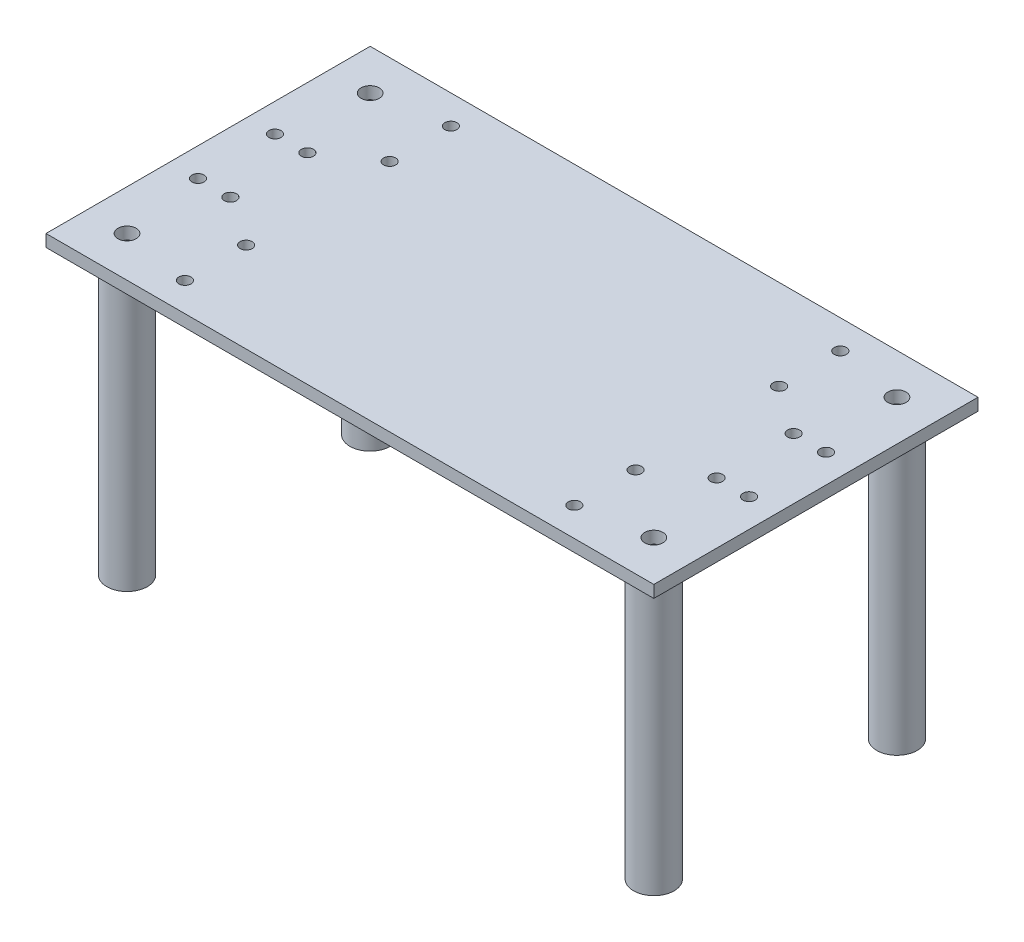
ISO-10303-21;
HEADER;
FILE_DESCRIPTION(('STEP AP214'),'2;1');
FILE_NAME('part.step','',(''),(''),'','','');
FILE_SCHEMA(('AUTOMOTIVE_DESIGN { 1 0 10303 214 1 1 1 1 }'));
ENDSEC;
DATA;
#1=APPLICATION_CONTEXT('core data for automotive mechanical design processes');
#2=APPLICATION_PROTOCOL_DEFINITION('international standard','automotive_design',2000,#1);
#3=PRODUCT_CONTEXT('',#1,'mechanical');
#4=PRODUCT('Part','Part','',(#3));
#5=PRODUCT_RELATED_PRODUCT_CATEGORY('part','',(#4));
#6=PRODUCT_DEFINITION_FORMATION('','',#4);
#7=PRODUCT_DEFINITION_CONTEXT('part definition',#1,'design');
#8=PRODUCT_DEFINITION('design','',#6,#7);
#9=PRODUCT_DEFINITION_SHAPE('','',#8);
#10=(LENGTH_UNIT() NAMED_UNIT(*) SI_UNIT(.MILLI.,.METRE.));
#11=(NAMED_UNIT(*) PLANE_ANGLE_UNIT() SI_UNIT($,.RADIAN.));
#12=(NAMED_UNIT(*) SI_UNIT($,.STERADIAN.) SOLID_ANGLE_UNIT());
#13=UNCERTAINTY_MEASURE_WITH_UNIT(LENGTH_MEASURE(1.E-05),#10,'distance_accuracy_value','');
#14=(GEOMETRIC_REPRESENTATION_CONTEXT(3) GLOBAL_UNCERTAINTY_ASSIGNED_CONTEXT((#13)) GLOBAL_UNIT_ASSIGNED_CONTEXT((#10,
#11,#12)) REPRESENTATION_CONTEXT('',''));
#15=CARTESIAN_POINT('',(0.,0.,0.));
#16=DIRECTION('',(0.,0.,1.));
#17=DIRECTION('',(1.,0.,0.));
#18=AXIS2_PLACEMENT_3D('',#15,#16,#17);
#19=CARTESIAN_POINT('',(66.5352697095436,-3.,0.));
#20=DIRECTION('',(-1.,0.,0.));
#21=DIRECTION('',(0.,0.,1.));
#22=AXIS2_PLACEMENT_3D('',#19,#20,#21);
#23=PLANE('',#22);
#24=DIRECTION('',(0.,0.,1.));
#25=VECTOR('',#24,1.);
#26=CARTESIAN_POINT('',(66.5352697095436,0.,0.));
#27=LINE('',#26,#25);
#28=CARTESIAN_POINT('',(66.5352697095435,0.,-41.8257261410789));
#29=VERTEX_POINT('',#28);
#30=CARTESIAN_POINT('',(66.5352697095436,0.,38.1742738589212));
#31=VERTEX_POINT('',#30);
#32=EDGE_CURVE('E129',#29,#31,#27,.T.);
#33=ORIENTED_EDGE('',*,*,#32,.T.);
#34=DIRECTION('',(0.,1.,0.));
#35=VECTOR('',#34,1.);
#36=CARTESIAN_POINT('',(66.5352697095436,-3.,38.1742738589212));
#37=LINE('',#36,#35);
#38=CARTESIAN_POINT('',(66.5352697095436,-3.,38.1742738589212));
#39=VERTEX_POINT('',#38);
#40=EDGE_CURVE('E78',#39,#31,#37,.T.);
#41=ORIENTED_EDGE('',*,*,#40,.F.);
#42=DIRECTION('',(0.,0.,1.));
#43=VECTOR('',#42,1.);
#44=CARTESIAN_POINT('',(66.5352697095436,-3.,0.));
#45=LINE('',#44,#43);
#46=CARTESIAN_POINT('',(66.5352697095435,-3.,-41.8257261410789));
#47=VERTEX_POINT('',#46);
#48=EDGE_CURVE('E54',#47,#39,#45,.T.);
#49=ORIENTED_EDGE('',*,*,#48,.F.);
#50=DIRECTION('',(0.,1.,0.));
#51=VECTOR('',#50,1.);
#52=CARTESIAN_POINT('',(66.5352697095435,-3.,-41.8257261410789));
#53=LINE('',#52,#51);
#54=EDGE_CURVE('E92',#47,#29,#53,.T.);
#55=ORIENTED_EDGE('',*,*,#54,.T.);
#56=EDGE_LOOP('',(#33,#41,#49,#55));
#57=FACE_BOUND('',#56,.T.);
#58=ADVANCED_FACE('F35',(#57),#23,.F.);
#59=CARTESIAN_POINT('',(0.,-3.,38.1742738589212));
#60=DIRECTION('',(0.,0.,1.));
#61=DIRECTION('',(1.,0.,0.));
#62=AXIS2_PLACEMENT_3D('',#59,#60,#61);
#63=PLANE('',#62);
#64=DIRECTION('',(1.,0.,0.));
#65=VECTOR('',#64,1.);
#66=CARTESIAN_POINT('',(0.,0.,38.1742738589212));
#67=LINE('',#66,#65);
#68=CARTESIAN_POINT('',(-83.4647302904564,0.,38.1742738589212));
#69=VERTEX_POINT('',#68);
#70=EDGE_CURVE('E134',#69,#31,#67,.T.);
#71=ORIENTED_EDGE('',*,*,#70,.F.);
#72=DIRECTION('',(0.,1.,0.));
#73=VECTOR('',#72,1.);
#74=CARTESIAN_POINT('',(-83.4647302904564,-3.,38.1742738589212));
#75=LINE('',#74,#73);
#76=CARTESIAN_POINT('',(-83.4647302904564,-3.,38.1742738589212));
#77=VERTEX_POINT('',#76);
#78=EDGE_CURVE('E71',#77,#69,#75,.T.);
#79=ORIENTED_EDGE('',*,*,#78,.F.);
#80=DIRECTION('',(1.,0.,0.));
#81=VECTOR('',#80,1.);
#82=CARTESIAN_POINT('',(0.,-3.,38.1742738589212));
#83=LINE('',#82,#81);
#84=EDGE_CURVE('E99',#77,#39,#83,.T.);
#85=ORIENTED_EDGE('',*,*,#84,.T.);
#86=ORIENTED_EDGE('',*,*,#40,.T.);
#87=EDGE_LOOP('',(#71,#79,#85,#86));
#88=FACE_BOUND('',#87,.T.);
#89=ADVANCED_FACE('F315',(#88),#63,.T.);
#90=CARTESIAN_POINT('',(-83.4647302904564,-3.,0.));
#91=DIRECTION('',(-1.,0.,0.));
#92=DIRECTION('',(0.,0.,1.));
#93=AXIS2_PLACEMENT_3D('',#90,#91,#92);
#94=PLANE('',#93);
#95=DIRECTION('',(0.,0.,1.));
#96=VECTOR('',#95,1.);
#97=CARTESIAN_POINT('',(-83.4647302904564,0.,0.));
#98=LINE('',#97,#96);
#99=CARTESIAN_POINT('',(-83.4647302904565,0.,-41.8257261410789));
#100=VERTEX_POINT('',#99);
#101=EDGE_CURVE('E89',#100,#69,#98,.T.);
#102=ORIENTED_EDGE('',*,*,#101,.F.);
#103=DIRECTION('',(0.,1.,0.));
#104=VECTOR('',#103,1.);
#105=CARTESIAN_POINT('',(-83.4647302904565,-3.,-41.8257261410789));
#106=LINE('',#105,#104);
#107=CARTESIAN_POINT('',(-83.4647302904565,-3.,-41.8257261410789));
#108=VERTEX_POINT('',#107);
#109=EDGE_CURVE('E86',#108,#100,#106,.T.);
#110=ORIENTED_EDGE('',*,*,#109,.F.);
#111=DIRECTION('',(0.,0.,1.));
#112=VECTOR('',#111,1.);
#113=CARTESIAN_POINT('',(-83.4647302904564,-3.,0.));
#114=LINE('',#113,#112);
#115=EDGE_CURVE('E88',#108,#77,#114,.T.);
#116=ORIENTED_EDGE('',*,*,#115,.T.);
#117=ORIENTED_EDGE('',*,*,#78,.T.);
#118=EDGE_LOOP('',(#102,#110,#116,#117));
#119=FACE_BOUND('',#118,.T.);
#120=ADVANCED_FACE('F87',(#119),#94,.T.);
#121=CARTESIAN_POINT('',(-68.4647302904565,-3.,-11.3257261410788));
#122=DIRECTION('',(0.,1.,0.));
#123=DIRECTION('',(0.,0.,1.));
#124=AXIS2_PLACEMENT_3D('',#121,#122,#123);
#125=CYLINDRICAL_SURFACE('',#124,1.5);
#126=CARTESIAN_POINT('',(-68.4647302904565,-3.,-11.3257261410788));
#127=DIRECTION('',(0.,1.,0.));
#128=DIRECTION('',(0.,0.,1.));
#129=AXIS2_PLACEMENT_3D('',#126,#127,#128);
#130=CIRCLE('',#129,1.5);
#131=CARTESIAN_POINT('',(-68.4647302904565,-3.,-9.82572614107885));
#132=VERTEX_POINT('',#131);
#133=EDGE_CURVE('E113',#132,#132,#130,.T.);
#134=ORIENTED_EDGE('',*,*,#133,.F.);
#135=EDGE_LOOP('',(#134));
#136=FACE_BOUND('',#135,.T.);
#137=CARTESIAN_POINT('',(-68.4647302904565,0.,-11.3257261410788));
#138=DIRECTION('',(0.,1.,0.));
#139=DIRECTION('',(0.,0.,1.));
#140=AXIS2_PLACEMENT_3D('',#137,#138,#139);
#141=CIRCLE('',#140,1.5);
#142=CARTESIAN_POINT('',(-68.4647302904565,0.,-9.82572614107885));
#143=VERTEX_POINT('',#142);
#144=EDGE_CURVE('E146',#143,#143,#141,.T.);
#145=ORIENTED_EDGE('',*,*,#144,.T.);
#146=EDGE_LOOP('',(#145));
#147=FACE_BOUND('',#146,.T.);
#148=ADVANCED_FACE('F785',(#136,#147),#125,.F.);
#149=CARTESIAN_POINT('',(-76.4647302904565,-3.,-11.3257261410788));
#150=DIRECTION('',(0.,1.,0.));
#151=DIRECTION('',(0.,0.,1.));
#152=AXIS2_PLACEMENT_3D('',#149,#150,#151);
#153=CYLINDRICAL_SURFACE('',#152,1.5);
#154=CARTESIAN_POINT('',(-76.4647302904565,-3.,-11.3257261410788));
#155=DIRECTION('',(0.,1.,0.));
#156=DIRECTION('',(0.,0.,1.));
#157=AXIS2_PLACEMENT_3D('',#154,#155,#156);
#158=CIRCLE('',#157,1.5);
#159=CARTESIAN_POINT('',(-76.4647302904565,-3.,-9.82572614107885));
#160=VERTEX_POINT('',#159);
#161=EDGE_CURVE('E110',#160,#160,#158,.T.);
#162=ORIENTED_EDGE('',*,*,#161,.F.);
#163=EDGE_LOOP('',(#162));
#164=FACE_BOUND('',#163,.T.);
#165=CARTESIAN_POINT('',(-76.4647302904565,0.,-11.3257261410788));
#166=DIRECTION('',(0.,1.,0.));
#167=DIRECTION('',(0.,0.,1.));
#168=AXIS2_PLACEMENT_3D('',#165,#166,#167);
#169=CIRCLE('',#168,1.5);
#170=CARTESIAN_POINT('',(-76.4647302904565,0.,-9.82572614107885));
#171=VERTEX_POINT('',#170);
#172=EDGE_CURVE('E143',#171,#171,#169,.T.);
#173=ORIENTED_EDGE('',*,*,#172,.T.);
#174=EDGE_LOOP('',(#173));
#175=FACE_BOUND('',#174,.T.);
#176=ADVANCED_FACE('F776',(#164,#175),#153,.F.);
#177=CARTESIAN_POINT('',(59.5352697095435,-3.,-11.3257261410789));
#178=DIRECTION('',(0.,1.,0.));
#179=DIRECTION('',(0.,0.,1.));
#180=AXIS2_PLACEMENT_3D('',#177,#178,#179);
#181=CYLINDRICAL_SURFACE('',#180,1.5);
#182=CARTESIAN_POINT('',(59.5352697095435,-3.,-11.3257261410789));
#183=DIRECTION('',(0.,1.,0.));
#184=DIRECTION('',(0.,0.,1.));
#185=AXIS2_PLACEMENT_3D('',#182,#183,#184);
#186=CIRCLE('',#185,1.5);
#187=CARTESIAN_POINT('',(59.5352697095435,-3.,-9.82572614107888));
#188=VERTEX_POINT('',#187);
#189=EDGE_CURVE('E107',#188,#188,#186,.F.);
#190=ORIENTED_EDGE('',*,*,#189,.T.);
#191=EDGE_LOOP('',(#190));
#192=FACE_BOUND('',#191,.T.);
#193=CARTESIAN_POINT('',(59.5352697095435,0.,-11.3257261410789));
#194=DIRECTION('',(0.,1.,0.));
#195=DIRECTION('',(0.,0.,1.));
#196=AXIS2_PLACEMENT_3D('',#193,#194,#195);
#197=CIRCLE('',#196,1.5);
#198=CARTESIAN_POINT('',(59.5352697095435,0.,-9.82572614107888));
#199=VERTEX_POINT('',#198);
#200=EDGE_CURVE('E140',#199,#199,#197,.F.);
#201=ORIENTED_EDGE('',*,*,#200,.F.);
#202=EDGE_LOOP('',(#201));
#203=FACE_BOUND('',#202,.T.);
#204=ADVANCED_FACE('F767',(#192,#203),#181,.F.);
#205=CARTESIAN_POINT('',(59.5352697095436,-3.,7.67427385892113));
#206=DIRECTION('',(0.,1.,0.));
#207=DIRECTION('',(0.,0.,1.));
#208=AXIS2_PLACEMENT_3D('',#205,#206,#207);
#209=CYLINDRICAL_SURFACE('',#208,1.5);
#210=CARTESIAN_POINT('',(59.5352697095436,-3.,7.67427385892113));
#211=DIRECTION('',(0.,1.,0.));
#212=DIRECTION('',(0.,0.,1.));
#213=AXIS2_PLACEMENT_3D('',#210,#211,#212);
#214=CIRCLE('',#213,1.5);
#215=CARTESIAN_POINT('',(59.5352697095436,-3.,9.17427385892113));
#216=VERTEX_POINT('',#215);
#217=EDGE_CURVE('E101',#216,#216,#214,.F.);
#218=ORIENTED_EDGE('',*,*,#217,.T.);
#219=EDGE_LOOP('',(#218));
#220=FACE_BOUND('',#219,.T.);
#221=CARTESIAN_POINT('',(59.5352697095436,0.,7.67427385892113));
#222=DIRECTION('',(0.,1.,0.));
#223=DIRECTION('',(0.,0.,1.));
#224=AXIS2_PLACEMENT_3D('',#221,#222,#223);
#225=CIRCLE('',#224,1.5);
#226=CARTESIAN_POINT('',(59.5352697095436,0.,9.17427385892113));
#227=VERTEX_POINT('',#226);
#228=EDGE_CURVE('E137',#227,#227,#225,.F.);
#229=ORIENTED_EDGE('',*,*,#228,.F.);
#230=EDGE_LOOP('',(#229));
#231=FACE_BOUND('',#230,.T.);
#232=ADVANCED_FACE('F760',(#220,#231),#209,.F.);
#233=CARTESIAN_POINT('',(0.,-3.,-41.8257261410789));
#234=DIRECTION('',(0.,0.,1.));
#235=DIRECTION('',(1.,0.,0.));
#236=AXIS2_PLACEMENT_3D('',#233,#234,#235);
#237=PLANE('',#236);
#238=DIRECTION('',(1.,0.,0.));
#239=VECTOR('',#238,1.);
#240=CARTESIAN_POINT('',(0.,0.,-41.8257261410789));
#241=LINE('',#240,#239);
#242=EDGE_CURVE('E131',#100,#29,#241,.T.);
#243=ORIENTED_EDGE('',*,*,#242,.T.);
#244=ORIENTED_EDGE('',*,*,#54,.F.);
#245=DIRECTION('',(1.,0.,0.));
#246=VECTOR('',#245,1.);
#247=CARTESIAN_POINT('',(0.,-3.,-41.8257261410789));
#248=LINE('',#247,#246);
#249=EDGE_CURVE('E83',#108,#47,#248,.T.);
#250=ORIENTED_EDGE('',*,*,#249,.F.);
#251=ORIENTED_EDGE('',*,*,#109,.T.);
#252=EDGE_LOOP('',(#243,#244,#250,#251));
#253=FACE_BOUND('',#252,.T.);
#254=ADVANCED_FACE('F94',(#253),#237,.F.);
#255=CARTESIAN_POINT('',(-68.4647302904565,-3.,7.67427385892115));
#256=DIRECTION('',(0.,1.,0.));
#257=DIRECTION('',(0.,0.,1.));
#258=AXIS2_PLACEMENT_3D('',#255,#256,#257);
#259=CYLINDRICAL_SURFACE('',#258,1.5);
#260=CARTESIAN_POINT('',(-68.4647302904565,-3.,7.67427385892115));
#261=DIRECTION('',(0.,1.,0.));
#262=DIRECTION('',(0.,0.,1.));
#263=AXIS2_PLACEMENT_3D('',#260,#261,#262);
#264=CIRCLE('',#263,1.5);
#265=CARTESIAN_POINT('',(-68.4647302904565,-3.,9.17427385892115));
#266=VERTEX_POINT('',#265);
#267=EDGE_CURVE('E270',#266,#266,#264,.T.);
#268=ORIENTED_EDGE('',*,*,#267,.F.);
#269=EDGE_LOOP('',(#268));
#270=FACE_BOUND('',#269,.T.);
#271=CARTESIAN_POINT('',(-68.4647302904565,0.,7.67427385892115));
#272=DIRECTION('',(0.,1.,0.));
#273=DIRECTION('',(0.,0.,1.));
#274=AXIS2_PLACEMENT_3D('',#271,#272,#273);
#275=CIRCLE('',#274,1.5);
#276=CARTESIAN_POINT('',(-68.4647302904565,0.,9.17427385892115));
#277=VERTEX_POINT('',#276);
#278=EDGE_CURVE('E126',#277,#277,#275,.T.);
#279=ORIENTED_EDGE('',*,*,#278,.T.);
#280=EDGE_LOOP('',(#279));
#281=FACE_BOUND('',#280,.T.);
#282=ADVANCED_FACE('F275',(#270,#281),#259,.F.);
#283=CARTESIAN_POINT('',(-76.4647302904564,-3.,7.67427385892115));
#284=DIRECTION('',(0.,1.,0.));
#285=DIRECTION('',(0.,0.,1.));
#286=AXIS2_PLACEMENT_3D('',#283,#284,#285);
#287=CYLINDRICAL_SURFACE('',#286,1.5);
#288=CARTESIAN_POINT('',(-76.4647302904564,-3.,7.67427385892115));
#289=DIRECTION('',(0.,1.,0.));
#290=DIRECTION('',(0.,0.,1.));
#291=AXIS2_PLACEMENT_3D('',#288,#289,#290);
#292=CIRCLE('',#291,1.5);
#293=CARTESIAN_POINT('',(-76.4647302904564,-3.,9.17427385892115));
#294=VERTEX_POINT('',#293);
#295=EDGE_CURVE('E267',#294,#294,#292,.T.);
#296=ORIENTED_EDGE('',*,*,#295,.F.);
#297=EDGE_LOOP('',(#296));
#298=FACE_BOUND('',#297,.T.);
#299=CARTESIAN_POINT('',(-76.4647302904564,0.,7.67427385892115));
#300=DIRECTION('',(0.,1.,0.));
#301=DIRECTION('',(0.,0.,1.));
#302=AXIS2_PLACEMENT_3D('',#299,#300,#301);
#303=CIRCLE('',#302,1.5);
#304=CARTESIAN_POINT('',(-76.4647302904564,0.,9.17427385892115));
#305=VERTEX_POINT('',#304);
#306=EDGE_CURVE('E122',#305,#305,#303,.T.);
#307=ORIENTED_EDGE('',*,*,#306,.T.);
#308=EDGE_LOOP('',(#307));
#309=FACE_BOUND('',#308,.T.);
#310=ADVANCED_FACE('F278',(#298,#309),#287,.F.);
#311=CARTESIAN_POINT('',(51.5352697095436,-3.,7.67427385892113));
#312=DIRECTION('',(0.,1.,0.));
#313=DIRECTION('',(0.,0.,1.));
#314=AXIS2_PLACEMENT_3D('',#311,#312,#313);
#315=CYLINDRICAL_SURFACE('',#314,1.5);
#316=CARTESIAN_POINT('',(51.5352697095436,-3.,7.67427385892113));
#317=DIRECTION('',(0.,1.,0.));
#318=DIRECTION('',(0.,0.,1.));
#319=AXIS2_PLACEMENT_3D('',#316,#317,#318);
#320=CIRCLE('',#319,1.5);
#321=CARTESIAN_POINT('',(51.5352697095436,-3.,9.17427385892113));
#322=VERTEX_POINT('',#321);
#323=EDGE_CURVE('E152',#322,#322,#320,.F.);
#324=ORIENTED_EDGE('',*,*,#323,.T.);
#325=EDGE_LOOP('',(#324));
#326=FACE_BOUND('',#325,.T.);
#327=CARTESIAN_POINT('',(51.5352697095436,0.,7.67427385892113));
#328=DIRECTION('',(0.,1.,0.));
#329=DIRECTION('',(0.,0.,1.));
#330=AXIS2_PLACEMENT_3D('',#327,#328,#329);
#331=CIRCLE('',#330,1.5);
#332=CARTESIAN_POINT('',(51.5352697095436,0.,9.17427385892113));
#333=VERTEX_POINT('',#332);
#334=EDGE_CURVE('E119',#333,#333,#331,.F.);
#335=ORIENTED_EDGE('',*,*,#334,.F.);
#336=EDGE_LOOP('',(#335));
#337=FACE_BOUND('',#336,.T.);
#338=ADVANCED_FACE('F37',(#326,#337),#315,.F.);
#339=CARTESIAN_POINT('',(51.5352697095436,-3.,-11.3257261410789));
#340=DIRECTION('',(0.,1.,0.));
#341=DIRECTION('',(0.,0.,1.));
#342=AXIS2_PLACEMENT_3D('',#339,#340,#341);
#343=CYLINDRICAL_SURFACE('',#342,1.49999999999999);
#344=CARTESIAN_POINT('',(51.5352697095436,-3.,-11.3257261410789));
#345=DIRECTION('',(0.,1.,0.));
#346=DIRECTION('',(0.,0.,1.));
#347=AXIS2_PLACEMENT_3D('',#344,#345,#346);
#348=CIRCLE('',#347,1.49999999999999);
#349=CARTESIAN_POINT('',(51.5352697095436,-3.,-9.82572614107888));
#350=VERTEX_POINT('',#349);
#351=EDGE_CURVE('E116',#350,#350,#348,.F.);
#352=ORIENTED_EDGE('',*,*,#351,.T.);
#353=EDGE_LOOP('',(#352));
#354=FACE_BOUND('',#353,.T.);
#355=CARTESIAN_POINT('',(51.5352697095436,0.,-11.3257261410789));
#356=DIRECTION('',(0.,1.,0.));
#357=DIRECTION('',(0.,0.,1.));
#358=AXIS2_PLACEMENT_3D('',#355,#356,#357);
#359=CIRCLE('',#358,1.49999999999999);
#360=CARTESIAN_POINT('',(51.5352697095436,0.,-9.82572614107888));
#361=VERTEX_POINT('',#360);
#362=EDGE_CURVE('E149',#361,#361,#359,.F.);
#363=ORIENTED_EDGE('',*,*,#362,.F.);
#364=EDGE_LOOP('',(#363));
#365=FACE_BOUND('',#364,.T.);
#366=ADVANCED_FACE('F300',(#354,#365),#343,.F.);
#367=CARTESIAN_POINT('',(0.,-3.,0.));
#368=DIRECTION('',(0.,1.,0.));
#369=DIRECTION('',(0.,0.,1.));
#370=AXIS2_PLACEMENT_3D('',#367,#368,#369);
#371=PLANE('',#370);
#372=CARTESIAN_POINT('',(-56.2842896987749,-3.,15.9693631912545));
#373=DIRECTION('',(0.,1.,0.));
#374=DIRECTION('',(0.,0.,1.));
#375=AXIS2_PLACEMENT_3D('',#372,#373,#374);
#376=CIRCLE('',#375,1.5);
#377=CARTESIAN_POINT('',(-56.2842896987749,-3.,17.4693631912545));
#378=VERTEX_POINT('',#377);
#379=EDGE_CURVE('E227',#378,#378,#376,.T.);
#380=ORIENTED_EDGE('',*,*,#379,.T.);
#381=EDGE_LOOP('',(#380));
#382=FACE_BOUND('',#381,.T.);
#383=CARTESIAN_POINT('',(39.655256430596,-3.,-19.6208154734122));
#384=DIRECTION('',(0.,1.,0.));
#385=DIRECTION('',(0.,0.,1.));
#386=AXIS2_PLACEMENT_3D('',#383,#384,#385);
#387=CIRCLE('',#386,1.5);
#388=CARTESIAN_POINT('',(39.655256430596,-3.,-18.1208154734122));
#389=VERTEX_POINT('',#388);
#390=EDGE_CURVE('E224',#389,#389,#387,.T.);
#391=ORIENTED_EDGE('',*,*,#390,.T.);
#392=EDGE_LOOP('',(#391));
#393=FACE_BOUND('',#392,.T.);
#394=CARTESIAN_POINT('',(39.655256430596,-3.,-34.7246623112916));
#395=DIRECTION('',(0.,1.,0.));
#396=DIRECTION('',(0.,0.,1.));
#397=AXIS2_PLACEMENT_3D('',#394,#395,#396);
#398=CIRCLE('',#397,1.5);
#399=CARTESIAN_POINT('',(39.655256430596,-3.,-33.2246623112916));
#400=VERTEX_POINT('',#399);
#401=EDGE_CURVE('E221',#400,#400,#398,.T.);
#402=ORIENTED_EDGE('',*,*,#401,.T.);
#403=EDGE_LOOP('',(#402));
#404=FACE_BOUND('',#403,.T.);
#405=CARTESIAN_POINT('',(-56.449797453919,-3.,-19.6208154734122));
#406=DIRECTION('',(0.,1.,0.));
#407=DIRECTION('',(0.,0.,1.));
#408=AXIS2_PLACEMENT_3D('',#405,#406,#407);
#409=CIRCLE('',#408,1.5);
#410=CARTESIAN_POINT('',(-56.449797453919,-3.,-18.1208154734122));
#411=VERTEX_POINT('',#410);
#412=EDGE_CURVE('E218',#411,#411,#409,.T.);
#413=ORIENTED_EDGE('',*,*,#412,.T.);
#414=EDGE_LOOP('',(#413));
#415=FACE_BOUND('',#414,.T.);
#416=CARTESIAN_POINT('',(39.8207641857401,-3.,31.0732100291339));
#417=DIRECTION('',(0.,1.,0.));
#418=DIRECTION('',(0.,0.,1.));
#419=AXIS2_PLACEMENT_3D('',#416,#417,#418);
#420=CIRCLE('',#419,1.5);
#421=CARTESIAN_POINT('',(39.8207641857401,-3.,32.5732100291339));
#422=VERTEX_POINT('',#421);
#423=EDGE_CURVE('E215',#422,#422,#420,.T.);
#424=ORIENTED_EDGE('',*,*,#423,.T.);
#425=EDGE_LOOP('',(#424));
#426=FACE_BOUND('',#425,.T.);
#427=CARTESIAN_POINT('',(39.8207641857401,-3.,15.9693631912545));
#428=DIRECTION('',(0.,1.,0.));
#429=DIRECTION('',(0.,0.,1.));
#430=AXIS2_PLACEMENT_3D('',#427,#428,#429);
#431=CIRCLE('',#430,1.5);
#432=CARTESIAN_POINT('',(39.8207641857401,-3.,17.4693631912545));
#433=VERTEX_POINT('',#432);
#434=EDGE_CURVE('E212',#433,#433,#431,.T.);
#435=ORIENTED_EDGE('',*,*,#434,.T.);
#436=EDGE_LOOP('',(#435));
#437=FACE_BOUND('',#436,.T.);
#438=CARTESIAN_POINT('',(-56.2842896987749,-3.,31.0732100291339));
#439=DIRECTION('',(0.,1.,0.));
#440=DIRECTION('',(0.,0.,1.));
#441=AXIS2_PLACEMENT_3D('',#438,#439,#440);
#442=CIRCLE('',#441,1.5);
#443=CARTESIAN_POINT('',(-56.2842896987749,-3.,32.5732100291339));
#444=VERTEX_POINT('',#443);
#445=EDGE_CURVE('E209',#444,#444,#442,.T.);
#446=ORIENTED_EDGE('',*,*,#445,.T.);
#447=EDGE_LOOP('',(#446));
#448=FACE_BOUND('',#447,.T.);
#449=CARTESIAN_POINT('',(-56.449797453919,-3.,-34.7246623112916));
#450=DIRECTION('',(0.,1.,0.));
#451=DIRECTION('',(0.,0.,1.));
#452=AXIS2_PLACEMENT_3D('',#449,#450,#451);
#453=CIRCLE('',#452,1.5);
#454=CARTESIAN_POINT('',(-56.449797453919,-3.,-33.2246623112916));
#455=VERTEX_POINT('',#454);
#456=EDGE_CURVE('E206',#455,#455,#453,.T.);
#457=ORIENTED_EDGE('',*,*,#456,.T.);
#458=EDGE_LOOP('',(#457));
#459=FACE_BOUND('',#458,.T.);
#460=CARTESIAN_POINT('',(-73.4647302904565,-3.,-31.8257261410788));
#461=DIRECTION('',(0.,1.,0.));
#462=DIRECTION('',(0.,0.,1.));
#463=AXIS2_PLACEMENT_3D('',#460,#461,#462);
#464=CIRCLE('',#463,5.);
#465=CARTESIAN_POINT('',(-73.4647302904565,-3.,-26.8257261410788));
#466=VERTEX_POINT('',#465);
#467=EDGE_CURVE('E11',#466,#466,#464,.F.);
#468=ORIENTED_EDGE('',*,*,#467,.F.);
#469=EDGE_LOOP('',(#468));
#470=FACE_BOUND('',#469,.T.);
#471=CARTESIAN_POINT('',(56.5352697095435,-3.,-31.8257261410788));
#472=DIRECTION('',(0.,1.,0.));
#473=DIRECTION('',(0.,0.,1.));
#474=AXIS2_PLACEMENT_3D('',#471,#472,#473);
#475=CIRCLE('',#474,5.);
#476=CARTESIAN_POINT('',(56.5352697095435,-3.,-26.8257261410788));
#477=VERTEX_POINT('',#476);
#478=EDGE_CURVE('E45',#477,#477,#475,.F.);
#479=ORIENTED_EDGE('',*,*,#478,.F.);
#480=EDGE_LOOP('',(#479));
#481=FACE_BOUND('',#480,.T.);
#482=CARTESIAN_POINT('',(56.5352697095435,-3.,28.1742738589212));
#483=DIRECTION('',(0.,1.,0.));
#484=DIRECTION('',(0.,0.,1.));
#485=AXIS2_PLACEMENT_3D('',#482,#483,#484);
#486=CIRCLE('',#485,5.);
#487=CARTESIAN_POINT('',(56.5352697095435,-3.,33.1742738589212));
#488=VERTEX_POINT('',#487);
#489=EDGE_CURVE('E159',#488,#488,#486,.F.);
#490=ORIENTED_EDGE('',*,*,#489,.F.);
#491=EDGE_LOOP('',(#490));
#492=FACE_BOUND('',#491,.T.);
#493=CARTESIAN_POINT('',(-73.4647302904565,-3.,28.1742738589212));
#494=DIRECTION('',(0.,1.,0.));
#495=DIRECTION('',(0.,0.,1.));
#496=AXIS2_PLACEMENT_3D('',#493,#494,#495);
#497=CIRCLE('',#496,5.);
#498=CARTESIAN_POINT('',(-73.4647302904565,-3.,33.1742738589212));
#499=VERTEX_POINT('',#498);
#500=EDGE_CURVE('E154',#499,#499,#497,.F.);
#501=ORIENTED_EDGE('',*,*,#500,.F.);
#502=EDGE_LOOP('',(#501));
#503=FACE_BOUND('',#502,.T.);
#504=ORIENTED_EDGE('',*,*,#323,.F.);
#505=EDGE_LOOP('',(#504));
#506=FACE_BOUND('',#505,.T.);
#507=ORIENTED_EDGE('',*,*,#295,.T.);
#508=EDGE_LOOP('',(#507));
#509=FACE_BOUND('',#508,.T.);
#510=ORIENTED_EDGE('',*,*,#267,.T.);
#511=EDGE_LOOP('',(#510));
#512=FACE_BOUND('',#511,.T.);
#513=ORIENTED_EDGE('',*,*,#48,.T.);
#514=ORIENTED_EDGE('',*,*,#84,.F.);
#515=ORIENTED_EDGE('',*,*,#115,.F.);
#516=ORIENTED_EDGE('',*,*,#249,.T.);
#517=EDGE_LOOP('',(#513,#514,#515,#516));
#518=FACE_BOUND('',#517,.T.);
#519=ORIENTED_EDGE('',*,*,#217,.F.);
#520=EDGE_LOOP('',(#519));
#521=FACE_BOUND('',#520,.T.);
#522=ORIENTED_EDGE('',*,*,#189,.F.);
#523=EDGE_LOOP('',(#522));
#524=FACE_BOUND('',#523,.T.);
#525=ORIENTED_EDGE('',*,*,#161,.T.);
#526=EDGE_LOOP('',(#525));
#527=FACE_BOUND('',#526,.T.);
#528=ORIENTED_EDGE('',*,*,#133,.T.);
#529=EDGE_LOOP('',(#528));
#530=FACE_BOUND('',#529,.T.);
#531=ORIENTED_EDGE('',*,*,#351,.F.);
#532=EDGE_LOOP('',(#531));
#533=FACE_BOUND('',#532,.T.);
#534=ADVANCED_FACE('F97',(#382,#393,#404,#415,#426,#437,#448,#459,#470,#481,#492,#503,#506,#509,
#512,#518,#521,#524,#527,#530,#533),#371,.F.);
#535=CARTESIAN_POINT('',(0.,0.,0.));
#536=DIRECTION('',(0.,1.,0.));
#537=DIRECTION('',(0.,0.,1.));
#538=AXIS2_PLACEMENT_3D('',#535,#536,#537);
#539=PLANE('',#538);
#540=CARTESIAN_POINT('',(-73.4647302904565,0.,-31.8257261410788));
#541=DIRECTION('',(0.,1.,0.));
#542=DIRECTION('',(0.,0.,1.));
#543=AXIS2_PLACEMENT_3D('',#540,#541,#542);
#544=CIRCLE('',#543,2.25);
#545=CARTESIAN_POINT('',(-73.4647302904565,0.,-29.5757261410789));
#546=VERTEX_POINT('',#545);
#547=EDGE_CURVE('E642',#546,#546,#544,.T.);
#548=ORIENTED_EDGE('',*,*,#547,.F.);
#549=EDGE_LOOP('',(#548));
#550=FACE_BOUND('',#549,.T.);
#551=CARTESIAN_POINT('',(-73.4647302904565,0.,28.1742738589212));
#552=DIRECTION('',(0.,1.,0.));
#553=DIRECTION('',(0.,0.,1.));
#554=AXIS2_PLACEMENT_3D('',#551,#552,#553);
#555=CIRCLE('',#554,2.25);
#556=CARTESIAN_POINT('',(-73.4647302904565,0.,30.4242738589212));
#557=VERTEX_POINT('',#556);
#558=EDGE_CURVE('E639',#557,#557,#555,.T.);
#559=ORIENTED_EDGE('',*,*,#558,.F.);
#560=EDGE_LOOP('',(#559));
#561=FACE_BOUND('',#560,.T.);
#562=CARTESIAN_POINT('',(56.5352697095435,0.,28.1742738589212));
#563=DIRECTION('',(0.,1.,0.));
#564=DIRECTION('',(0.,0.,1.));
#565=AXIS2_PLACEMENT_3D('',#562,#563,#564);
#566=CIRCLE('',#565,2.25);
#567=CARTESIAN_POINT('',(56.5352697095435,0.,30.4242738589212));
#568=VERTEX_POINT('',#567);
#569=EDGE_CURVE('E641',#568,#568,#566,.T.);
#570=ORIENTED_EDGE('',*,*,#569,.F.);
#571=EDGE_LOOP('',(#570));
#572=FACE_BOUND('',#571,.T.);
#573=CARTESIAN_POINT('',(56.5352697095435,0.,-31.8257261410788));
#574=DIRECTION('',(0.,1.,0.));
#575=DIRECTION('',(0.,0.,1.));
#576=AXIS2_PLACEMENT_3D('',#573,#574,#575);
#577=CIRCLE('',#576,2.25);
#578=CARTESIAN_POINT('',(56.5352697095435,0.,-29.5757261410788));
#579=VERTEX_POINT('',#578);
#580=EDGE_CURVE('E168',#579,#579,#577,.T.);
#581=ORIENTED_EDGE('',*,*,#580,.F.);
#582=EDGE_LOOP('',(#581));
#583=FACE_BOUND('',#582,.T.);
#584=CARTESIAN_POINT('',(-56.2842896987749,0.,15.9693631912545));
#585=DIRECTION('',(0.,1.,0.));
#586=DIRECTION('',(0.,0.,1.));
#587=AXIS2_PLACEMENT_3D('',#584,#585,#586);
#588=CIRCLE('',#587,1.5);
#589=CARTESIAN_POINT('',(-56.2842896987749,0.,17.4693631912545));
#590=VERTEX_POINT('',#589);
#591=EDGE_CURVE('E190',#590,#590,#588,.T.);
#592=ORIENTED_EDGE('',*,*,#591,.F.);
#593=EDGE_LOOP('',(#592));
#594=FACE_BOUND('',#593,.T.);
#595=CARTESIAN_POINT('',(39.655256430596,0.,-19.6208154734122));
#596=DIRECTION('',(0.,1.,0.));
#597=DIRECTION('',(0.,0.,1.));
#598=AXIS2_PLACEMENT_3D('',#595,#596,#597);
#599=CIRCLE('',#598,1.5);
#600=CARTESIAN_POINT('',(39.655256430596,0.,-18.1208154734122));
#601=VERTEX_POINT('',#600);
#602=EDGE_CURVE('E192',#601,#601,#599,.T.);
#603=ORIENTED_EDGE('',*,*,#602,.F.);
#604=EDGE_LOOP('',(#603));
#605=FACE_BOUND('',#604,.T.);
#606=CARTESIAN_POINT('',(39.655256430596,0.,-34.7246623112916));
#607=DIRECTION('',(0.,1.,0.));
#608=DIRECTION('',(0.,0.,1.));
#609=AXIS2_PLACEMENT_3D('',#606,#607,#608);
#610=CIRCLE('',#609,1.5);
#611=CARTESIAN_POINT('',(39.655256430596,0.,-33.2246623112916));
#612=VERTEX_POINT('',#611);
#613=EDGE_CURVE('E195',#612,#612,#610,.T.);
#614=ORIENTED_EDGE('',*,*,#613,.F.);
#615=EDGE_LOOP('',(#614));
#616=FACE_BOUND('',#615,.T.);
#617=CARTESIAN_POINT('',(-56.449797453919,0.,-19.6208154734122));
#618=DIRECTION('',(0.,1.,0.));
#619=DIRECTION('',(0.,0.,1.));
#620=AXIS2_PLACEMENT_3D('',#617,#618,#619);
#621=CIRCLE('',#620,1.5);
#622=CARTESIAN_POINT('',(-56.449797453919,0.,-18.1208154734122));
#623=VERTEX_POINT('',#622);
#624=EDGE_CURVE('E198',#623,#623,#621,.T.);
#625=ORIENTED_EDGE('',*,*,#624,.F.);
#626=EDGE_LOOP('',(#625));
#627=FACE_BOUND('',#626,.T.);
#628=CARTESIAN_POINT('',(39.8207641857401,0.,31.0732100291339));
#629=DIRECTION('',(0.,1.,0.));
#630=DIRECTION('',(0.,0.,1.));
#631=AXIS2_PLACEMENT_3D('',#628,#629,#630);
#632=CIRCLE('',#631,1.5);
#633=CARTESIAN_POINT('',(39.8207641857401,0.,32.5732100291339));
#634=VERTEX_POINT('',#633);
#635=EDGE_CURVE('E175',#634,#634,#632,.T.);
#636=ORIENTED_EDGE('',*,*,#635,.F.);
#637=EDGE_LOOP('',(#636));
#638=FACE_BOUND('',#637,.T.);
#639=CARTESIAN_POINT('',(39.8207641857401,0.,15.9693631912545));
#640=DIRECTION('',(0.,1.,0.));
#641=DIRECTION('',(0.,0.,1.));
#642=AXIS2_PLACEMENT_3D('',#639,#640,#641);
#643=CIRCLE('',#642,1.5);
#644=CARTESIAN_POINT('',(39.8207641857401,0.,17.4693631912545));
#645=VERTEX_POINT('',#644);
#646=EDGE_CURVE('E179',#645,#645,#643,.T.);
#647=ORIENTED_EDGE('',*,*,#646,.F.);
#648=EDGE_LOOP('',(#647));
#649=FACE_BOUND('',#648,.T.);
#650=CARTESIAN_POINT('',(-56.2842896987749,0.,31.0732100291339));
#651=DIRECTION('',(0.,1.,0.));
#652=DIRECTION('',(0.,0.,1.));
#653=AXIS2_PLACEMENT_3D('',#650,#651,#652);
#654=CIRCLE('',#653,1.5);
#655=CARTESIAN_POINT('',(-56.2842896987749,0.,32.5732100291339));
#656=VERTEX_POINT('',#655);
#657=EDGE_CURVE('E184',#656,#656,#654,.T.);
#658=ORIENTED_EDGE('',*,*,#657,.F.);
#659=EDGE_LOOP('',(#658));
#660=FACE_BOUND('',#659,.T.);
#661=CARTESIAN_POINT('',(-56.449797453919,0.,-34.7246623112916));
#662=DIRECTION('',(0.,1.,0.));
#663=DIRECTION('',(0.,0.,1.));
#664=AXIS2_PLACEMENT_3D('',#661,#662,#663);
#665=CIRCLE('',#664,1.5);
#666=CARTESIAN_POINT('',(-56.449797453919,0.,-33.2246623112916));
#667=VERTEX_POINT('',#666);
#668=EDGE_CURVE('E201',#667,#667,#665,.T.);
#669=ORIENTED_EDGE('',*,*,#668,.F.);
#670=EDGE_LOOP('',(#669));
#671=FACE_BOUND('',#670,.T.);
#672=ORIENTED_EDGE('',*,*,#334,.T.);
#673=EDGE_LOOP('',(#672));
#674=FACE_BOUND('',#673,.T.);
#675=ORIENTED_EDGE('',*,*,#306,.F.);
#676=EDGE_LOOP('',(#675));
#677=FACE_BOUND('',#676,.T.);
#678=ORIENTED_EDGE('',*,*,#278,.F.);
#679=EDGE_LOOP('',(#678));
#680=FACE_BOUND('',#679,.T.);
#681=ORIENTED_EDGE('',*,*,#32,.F.);
#682=ORIENTED_EDGE('',*,*,#242,.F.);
#683=ORIENTED_EDGE('',*,*,#101,.T.);
#684=ORIENTED_EDGE('',*,*,#70,.T.);
#685=EDGE_LOOP('',(#681,#682,#683,#684));
#686=FACE_BOUND('',#685,.T.);
#687=ORIENTED_EDGE('',*,*,#228,.T.);
#688=EDGE_LOOP('',(#687));
#689=FACE_BOUND('',#688,.T.);
#690=ORIENTED_EDGE('',*,*,#200,.T.);
#691=EDGE_LOOP('',(#690));
#692=FACE_BOUND('',#691,.T.);
#693=ORIENTED_EDGE('',*,*,#172,.F.);
#694=EDGE_LOOP('',(#693));
#695=FACE_BOUND('',#694,.T.);
#696=ORIENTED_EDGE('',*,*,#144,.F.);
#697=EDGE_LOOP('',(#696));
#698=FACE_BOUND('',#697,.T.);
#699=ORIENTED_EDGE('',*,*,#362,.T.);
#700=EDGE_LOOP('',(#699));
#701=FACE_BOUND('',#700,.T.);
#702=ADVANCED_FACE('F282',(#550,#561,#572,#583,#594,#605,#616,#627,#638,#649,#660,#671,#674,
#677,#680,#686,#689,#692,#695,#698,#701),#539,.T.);
#703=CARTESIAN_POINT('',(-73.4647302904565,-73.,28.1742738589212));
#704=DIRECTION('',(0.,-1.,0.));
#705=DIRECTION('',(0.,0.,-1.));
#706=AXIS2_PLACEMENT_3D('',#703,#704,#705);
#707=PLANE('',#706);
#708=CARTESIAN_POINT('',(-73.4647302904565,-73.,28.1742738589212));
#709=DIRECTION('',(0.,-1.,0.));
#710=DIRECTION('',(0.,0.,-1.));
#711=AXIS2_PLACEMENT_3D('',#708,#709,#710);
#712=CIRCLE('',#711,5.);
#713=CARTESIAN_POINT('',(-73.4647302904565,-73.,23.1742738589212));
#714=VERTEX_POINT('',#713);
#715=EDGE_CURVE('E123',#714,#714,#712,.T.);
#716=ORIENTED_EDGE('',*,*,#715,.T.);
#717=EDGE_LOOP('',(#716));
#718=FACE_BOUND('',#717,.T.);
#719=CARTESIAN_POINT('',(-73.4647302904565,-73.,28.1742738589212));
#720=DIRECTION('',(0.,-1.,0.));
#721=DIRECTION('',(0.,0.,-1.));
#722=AXIS2_PLACEMENT_3D('',#719,#720,#721);
#723=CIRCLE('',#722,2.50000000000001);
#724=CARTESIAN_POINT('',(-73.4647302904565,-73.,25.6742738589211));
#725=VERTEX_POINT('',#724);
#726=EDGE_CURVE('E258',#725,#725,#723,.T.);
#727=ORIENTED_EDGE('',*,*,#726,.F.);
#728=EDGE_LOOP('',(#727));
#729=FACE_BOUND('',#728,.T.);
#730=ADVANCED_FACE('F285',(#718,#729),#707,.T.);
#731=CARTESIAN_POINT('',(-73.4647302904565,-73.,28.1742738589212));
#732=DIRECTION('',(0.,1.,0.));
#733=DIRECTION('',(0.,0.,1.));
#734=AXIS2_PLACEMENT_3D('',#731,#732,#733);
#735=CYLINDRICAL_SURFACE('',#734,5.);
#736=ORIENTED_EDGE('',*,*,#715,.F.);
#737=EDGE_LOOP('',(#736));
#738=FACE_BOUND('',#737,.T.);
#739=ORIENTED_EDGE('',*,*,#500,.T.);
#740=EDGE_LOOP('',(#739));
#741=FACE_BOUND('',#740,.T.);
#742=ADVANCED_FACE('F354',(#738,#741),#735,.T.);
#743=CARTESIAN_POINT('',(-73.4647302904565,-73.,28.1742738589212));
#744=DIRECTION('',(0.,1.,0.));
#745=DIRECTION('',(0.,0.,1.));
#746=AXIS2_PLACEMENT_3D('',#743,#744,#745);
#747=CYLINDRICAL_SURFACE('',#746,2.50000000000001);
#748=ORIENTED_EDGE('',*,*,#726,.T.);
#749=EDGE_LOOP('',(#748));
#750=FACE_BOUND('',#749,.T.);
#751=CARTESIAN_POINT('',(-73.4647302904565,-3.,28.1742738589212));
#752=DIRECTION('',(0.,-1.,0.));
#753=DIRECTION('',(0.,0.,-1.));
#754=AXIS2_PLACEMENT_3D('',#751,#752,#753);
#755=CIRCLE('',#754,2.50000000000001);
#756=CARTESIAN_POINT('',(-73.4647302904565,-3.,25.6742738589211));
#757=VERTEX_POINT('',#756);
#758=EDGE_CURVE('E257',#757,#757,#755,.T.);
#759=ORIENTED_EDGE('',*,*,#758,.F.);
#760=EDGE_LOOP('',(#759));
#761=FACE_BOUND('',#760,.T.);
#762=ADVANCED_FACE('F365',(#750,#761),#747,.F.);
#763=CARTESIAN_POINT('',(-73.4647302904565,-3.,28.1742738589212));
#764=DIRECTION('',(0.,1.,0.));
#765=DIRECTION('',(0.,0.,1.));
#766=AXIS2_PLACEMENT_3D('',#763,#764,#765);
#767=CIRCLE('',#766,2.25);
#768=CARTESIAN_POINT('',(-73.4647302904565,-3.,30.4242738589212));
#769=VERTEX_POINT('',#768);
#770=EDGE_CURVE('E39',#769,#769,#767,.T.);
#771=ORIENTED_EDGE('',*,*,#770,.T.);
#772=EDGE_LOOP('',(#771));
#773=FACE_BOUND('',#772,.T.);
#774=ORIENTED_EDGE('',*,*,#758,.T.);
#775=EDGE_LOOP('',(#774));
#776=FACE_BOUND('',#775,.T.);
#777=ADVANCED_FACE('F311',(#773,#776),#371,.F.);
#778=CARTESIAN_POINT('',(56.5352697095435,-73.,28.1742738589212));
#779=DIRECTION('',(0.,-1.,0.));
#780=DIRECTION('',(0.,0.,-1.));
#781=AXIS2_PLACEMENT_3D('',#778,#779,#780);
#782=PLANE('',#781);
#783=CARTESIAN_POINT('',(56.5352697095435,-73.,28.1742738589212));
#784=DIRECTION('',(0.,-1.,0.));
#785=DIRECTION('',(0.,0.,-1.));
#786=AXIS2_PLACEMENT_3D('',#783,#784,#785);
#787=CIRCLE('',#786,5.);
#788=CARTESIAN_POINT('',(56.5352697095435,-73.,23.1742738589212));
#789=VERTEX_POINT('',#788);
#790=EDGE_CURVE('E252',#789,#789,#787,.T.);
#791=ORIENTED_EDGE('',*,*,#790,.T.);
#792=EDGE_LOOP('',(#791));
#793=FACE_BOUND('',#792,.T.);
#794=CARTESIAN_POINT('',(56.5352697095435,-73.,28.1742738589212));
#795=DIRECTION('',(0.,-1.,0.));
#796=DIRECTION('',(0.,0.,-1.));
#797=AXIS2_PLACEMENT_3D('',#794,#795,#796);
#798=CIRCLE('',#797,2.5);
#799=CARTESIAN_POINT('',(56.5352697095435,-73.,25.6742738589212));
#800=VERTEX_POINT('',#799);
#801=EDGE_CURVE('E249',#800,#800,#798,.T.);
#802=ORIENTED_EDGE('',*,*,#801,.F.);
#803=EDGE_LOOP('',(#802));
#804=FACE_BOUND('',#803,.T.);
#805=ADVANCED_FACE('F382',(#793,#804),#782,.T.);
#806=CARTESIAN_POINT('',(56.5352697095435,-73.,28.1742738589212));
#807=DIRECTION('',(0.,1.,0.));
#808=DIRECTION('',(0.,0.,1.));
#809=AXIS2_PLACEMENT_3D('',#806,#807,#808);
#810=CYLINDRICAL_SURFACE('',#809,5.);
#811=ORIENTED_EDGE('',*,*,#790,.F.);
#812=EDGE_LOOP('',(#811));
#813=FACE_BOUND('',#812,.T.);
#814=ORIENTED_EDGE('',*,*,#489,.T.);
#815=EDGE_LOOP('',(#814));
#816=FACE_BOUND('',#815,.T.);
#817=ADVANCED_FACE('F386',(#813,#816),#810,.T.);
#818=CARTESIAN_POINT('',(56.5352697095435,-73.,28.1742738589212));
#819=DIRECTION('',(0.,1.,0.));
#820=DIRECTION('',(0.,0.,1.));
#821=AXIS2_PLACEMENT_3D('',#818,#819,#820);
#822=CYLINDRICAL_SURFACE('',#821,2.5);
#823=ORIENTED_EDGE('',*,*,#801,.T.);
#824=EDGE_LOOP('',(#823));
#825=FACE_BOUND('',#824,.T.);
#826=CARTESIAN_POINT('',(56.5352697095435,-3.,28.1742738589212));
#827=DIRECTION('',(0.,-1.,0.));
#828=DIRECTION('',(0.,0.,-1.));
#829=AXIS2_PLACEMENT_3D('',#826,#827,#828);
#830=CIRCLE('',#829,2.5);
#831=CARTESIAN_POINT('',(56.5352697095435,-3.,25.6742738589212));
#832=VERTEX_POINT('',#831);
#833=EDGE_CURVE('E248',#832,#832,#830,.T.);
#834=ORIENTED_EDGE('',*,*,#833,.F.);
#835=EDGE_LOOP('',(#834));
#836=FACE_BOUND('',#835,.T.);
#837=ADVANCED_FACE('F396',(#825,#836),#822,.F.);
#838=CARTESIAN_POINT('',(56.5352697095435,-3.,28.1742738589212));
#839=DIRECTION('',(0.,1.,0.));
#840=DIRECTION('',(0.,0.,1.));
#841=AXIS2_PLACEMENT_3D('',#838,#839,#840);
#842=CIRCLE('',#841,2.25);
#843=CARTESIAN_POINT('',(56.5352697095435,-3.,30.4242738589212));
#844=VERTEX_POINT('',#843);
#845=EDGE_CURVE('E170',#844,#844,#842,.T.);
#846=ORIENTED_EDGE('',*,*,#845,.T.);
#847=EDGE_LOOP('',(#846));
#848=FACE_BOUND('',#847,.T.);
#849=ORIENTED_EDGE('',*,*,#833,.T.);
#850=EDGE_LOOP('',(#849));
#851=FACE_BOUND('',#850,.T.);
#852=ADVANCED_FACE('F406',(#848,#851),#371,.F.);
#853=CARTESIAN_POINT('',(56.5352697095435,-73.,-31.8257261410788));
#854=DIRECTION('',(0.,-1.,0.));
#855=DIRECTION('',(0.,0.,-1.));
#856=AXIS2_PLACEMENT_3D('',#853,#854,#855);
#857=PLANE('',#856);
#858=CARTESIAN_POINT('',(56.5352697095435,-73.,-31.8257261410788));
#859=DIRECTION('',(0.,-1.,0.));
#860=DIRECTION('',(0.,0.,-1.));
#861=AXIS2_PLACEMENT_3D('',#858,#859,#860);
#862=CIRCLE('',#861,5.);
#863=CARTESIAN_POINT('',(56.5352697095435,-73.,-36.8257261410788));
#864=VERTEX_POINT('',#863);
#865=EDGE_CURVE('E243',#864,#864,#862,.T.);
#866=ORIENTED_EDGE('',*,*,#865,.T.);
#867=EDGE_LOOP('',(#866));
#868=FACE_BOUND('',#867,.T.);
#869=CARTESIAN_POINT('',(56.5352697095435,-73.,-31.8257261410788));
#870=DIRECTION('',(0.,-1.,0.));
#871=DIRECTION('',(0.,0.,-1.));
#872=AXIS2_PLACEMENT_3D('',#869,#870,#871);
#873=CIRCLE('',#872,2.5);
#874=CARTESIAN_POINT('',(56.5352697095435,-73.,-34.3257261410789));
#875=VERTEX_POINT('',#874);
#876=EDGE_CURVE('E240',#875,#875,#873,.T.);
#877=ORIENTED_EDGE('',*,*,#876,.F.);
#878=EDGE_LOOP('',(#877));
#879=FACE_BOUND('',#878,.T.);
#880=ADVANCED_FACE('F414',(#868,#879),#857,.T.);
#881=CARTESIAN_POINT('',(56.5352697095435,-73.,-31.8257261410788));
#882=DIRECTION('',(0.,1.,0.));
#883=DIRECTION('',(0.,0.,1.));
#884=AXIS2_PLACEMENT_3D('',#881,#882,#883);
#885=CYLINDRICAL_SURFACE('',#884,5.);
#886=ORIENTED_EDGE('',*,*,#865,.F.);
#887=EDGE_LOOP('',(#886));
#888=FACE_BOUND('',#887,.T.);
#889=ORIENTED_EDGE('',*,*,#478,.T.);
#890=EDGE_LOOP('',(#889));
#891=FACE_BOUND('',#890,.T.);
#892=ADVANCED_FACE('F418',(#888,#891),#885,.T.);
#893=CARTESIAN_POINT('',(56.5352697095435,-73.,-31.8257261410788));
#894=DIRECTION('',(0.,1.,0.));
#895=DIRECTION('',(0.,0.,1.));
#896=AXIS2_PLACEMENT_3D('',#893,#894,#895);
#897=CYLINDRICAL_SURFACE('',#896,2.5);
#898=ORIENTED_EDGE('',*,*,#876,.T.);
#899=EDGE_LOOP('',(#898));
#900=FACE_BOUND('',#899,.T.);
#901=CARTESIAN_POINT('',(56.5352697095435,-3.,-31.8257261410788));
#902=DIRECTION('',(0.,-1.,0.));
#903=DIRECTION('',(0.,0.,-1.));
#904=AXIS2_PLACEMENT_3D('',#901,#902,#903);
#905=CIRCLE('',#904,2.5);
#906=CARTESIAN_POINT('',(56.5352697095435,-3.,-34.3257261410789));
#907=VERTEX_POINT('',#906);
#908=EDGE_CURVE('E239',#907,#907,#905,.T.);
#909=ORIENTED_EDGE('',*,*,#908,.F.);
#910=EDGE_LOOP('',(#909));
#911=FACE_BOUND('',#910,.T.);
#912=ADVANCED_FACE('F428',(#900,#911),#897,.F.);
#913=CARTESIAN_POINT('',(56.5352697095435,-3.,-31.8257261410788));
#914=DIRECTION('',(0.,1.,0.));
#915=DIRECTION('',(0.,0.,1.));
#916=AXIS2_PLACEMENT_3D('',#913,#914,#915);
#917=CIRCLE('',#916,2.25);
#918=CARTESIAN_POINT('',(56.5352697095435,-3.,-29.5757261410788));
#919=VERTEX_POINT('',#918);
#920=EDGE_CURVE('E167',#919,#919,#917,.T.);
#921=ORIENTED_EDGE('',*,*,#920,.T.);
#922=EDGE_LOOP('',(#921));
#923=FACE_BOUND('',#922,.T.);
#924=ORIENTED_EDGE('',*,*,#908,.T.);
#925=EDGE_LOOP('',(#924));
#926=FACE_BOUND('',#925,.T.);
#927=ADVANCED_FACE('F438',(#923,#926),#371,.F.);
#928=CARTESIAN_POINT('',(-73.4647302904565,-73.,-31.8257261410788));
#929=DIRECTION('',(0.,-1.,0.));
#930=DIRECTION('',(0.,0.,-1.));
#931=AXIS2_PLACEMENT_3D('',#928,#929,#930);
#932=PLANE('',#931);
#933=CARTESIAN_POINT('',(-73.4647302904565,-73.,-31.8257261410788));
#934=DIRECTION('',(0.,-1.,0.));
#935=DIRECTION('',(0.,0.,-1.));
#936=AXIS2_PLACEMENT_3D('',#933,#934,#935);
#937=CIRCLE('',#936,5.);
#938=CARTESIAN_POINT('',(-73.4647302904565,-73.,-36.8257261410789));
#939=VERTEX_POINT('',#938);
#940=EDGE_CURVE('E234',#939,#939,#937,.T.);
#941=ORIENTED_EDGE('',*,*,#940,.T.);
#942=EDGE_LOOP('',(#941));
#943=FACE_BOUND('',#942,.T.);
#944=CARTESIAN_POINT('',(-73.4647302904565,-73.,-31.8257261410788));
#945=DIRECTION('',(0.,-1.,0.));
#946=DIRECTION('',(0.,0.,-1.));
#947=AXIS2_PLACEMENT_3D('',#944,#945,#946);
#948=CIRCLE('',#947,2.50000000000001);
#949=CARTESIAN_POINT('',(-73.4647302904565,-73.,-34.3257261410789));
#950=VERTEX_POINT('',#949);
#951=EDGE_CURVE('E231',#950,#950,#948,.T.);
#952=ORIENTED_EDGE('',*,*,#951,.F.);
#953=EDGE_LOOP('',(#952));
#954=FACE_BOUND('',#953,.T.);
#955=ADVANCED_FACE('F446',(#943,#954),#932,.T.);
#956=CARTESIAN_POINT('',(-73.4647302904565,-73.,-31.8257261410788));
#957=DIRECTION('',(0.,1.,0.));
#958=DIRECTION('',(0.,0.,1.));
#959=AXIS2_PLACEMENT_3D('',#956,#957,#958);
#960=CYLINDRICAL_SURFACE('',#959,5.);
#961=ORIENTED_EDGE('',*,*,#940,.F.);
#962=EDGE_LOOP('',(#961));
#963=FACE_BOUND('',#962,.T.);
#964=ORIENTED_EDGE('',*,*,#467,.T.);
#965=EDGE_LOOP('',(#964));
#966=FACE_BOUND('',#965,.T.);
#967=ADVANCED_FACE('F450',(#963,#966),#960,.T.);
#968=CARTESIAN_POINT('',(-73.4647302904565,-73.,-31.8257261410788));
#969=DIRECTION('',(0.,1.,0.));
#970=DIRECTION('',(0.,0.,1.));
#971=AXIS2_PLACEMENT_3D('',#968,#969,#970);
#972=CYLINDRICAL_SURFACE('',#971,2.50000000000001);
#973=ORIENTED_EDGE('',*,*,#951,.T.);
#974=EDGE_LOOP('',(#973));
#975=FACE_BOUND('',#974,.T.);
#976=CARTESIAN_POINT('',(-73.4647302904565,-3.,-31.8257261410788));
#977=DIRECTION('',(0.,-1.,0.));
#978=DIRECTION('',(0.,0.,-1.));
#979=AXIS2_PLACEMENT_3D('',#976,#977,#978);
#980=CIRCLE('',#979,2.50000000000001);
#981=CARTESIAN_POINT('',(-73.4647302904565,-3.,-34.3257261410789));
#982=VERTEX_POINT('',#981);
#983=EDGE_CURVE('E230',#982,#982,#980,.T.);
#984=ORIENTED_EDGE('',*,*,#983,.F.);
#985=EDGE_LOOP('',(#984));
#986=FACE_BOUND('',#985,.T.);
#987=ADVANCED_FACE('F460',(#975,#986),#972,.F.);
#988=CARTESIAN_POINT('',(-73.4647302904565,-3.,-31.8257261410788));
#989=DIRECTION('',(0.,1.,0.));
#990=DIRECTION('',(0.,0.,1.));
#991=AXIS2_PLACEMENT_3D('',#988,#989,#990);
#992=CIRCLE('',#991,2.25);
#993=CARTESIAN_POINT('',(-73.4647302904565,-3.,-29.5757261410789));
#994=VERTEX_POINT('',#993);
#995=EDGE_CURVE('E164',#994,#994,#992,.T.);
#996=ORIENTED_EDGE('',*,*,#995,.T.);
#997=EDGE_LOOP('',(#996));
#998=FACE_BOUND('',#997,.T.);
#999=ORIENTED_EDGE('',*,*,#983,.T.);
#1000=EDGE_LOOP('',(#999));
#1001=FACE_BOUND('',#1000,.T.);
#1002=ADVANCED_FACE('F310',(#998,#1001),#371,.F.);
#1003=CARTESIAN_POINT('',(-56.449797453919,-10.,-34.7246623112916));
#1004=DIRECTION('',(0.,1.,0.));
#1005=DIRECTION('',(0.,0.,1.));
#1006=AXIS2_PLACEMENT_3D('',#1003,#1004,#1005);
#1007=CYLINDRICAL_SURFACE('',#1006,1.5);
#1008=ORIENTED_EDGE('',*,*,#668,.T.);
#1009=EDGE_LOOP('',(#1008));
#1010=FACE_BOUND('',#1009,.T.);
#1011=ORIENTED_EDGE('',*,*,#456,.F.);
#1012=EDGE_LOOP('',(#1011));
#1013=FACE_BOUND('',#1012,.T.);
#1014=ADVANCED_FACE('F484',(#1010,#1013),#1007,.F.);
#1015=CARTESIAN_POINT('',(-56.2842896987749,-10.,31.0732100291339));
#1016=DIRECTION('',(0.,1.,0.));
#1017=DIRECTION('',(0.,0.,1.));
#1018=AXIS2_PLACEMENT_3D('',#1015,#1016,#1017);
#1019=CYLINDRICAL_SURFACE('',#1018,1.5);
#1020=ORIENTED_EDGE('',*,*,#657,.T.);
#1021=EDGE_LOOP('',(#1020));
#1022=FACE_BOUND('',#1021,.T.);
#1023=ORIENTED_EDGE('',*,*,#445,.F.);
#1024=EDGE_LOOP('',(#1023));
#1025=FACE_BOUND('',#1024,.T.);
#1026=ADVANCED_FACE('F488',(#1022,#1025),#1019,.F.);
#1027=CARTESIAN_POINT('',(39.8207641857401,-10.,15.9693631912545));
#1028=DIRECTION('',(0.,1.,0.));
#1029=DIRECTION('',(0.,0.,1.));
#1030=AXIS2_PLACEMENT_3D('',#1027,#1028,#1029);
#1031=CYLINDRICAL_SURFACE('',#1030,1.5);
#1032=ORIENTED_EDGE('',*,*,#646,.T.);
#1033=EDGE_LOOP('',(#1032));
#1034=FACE_BOUND('',#1033,.T.);
#1035=ORIENTED_EDGE('',*,*,#434,.F.);
#1036=EDGE_LOOP('',(#1035));
#1037=FACE_BOUND('',#1036,.T.);
#1038=ADVANCED_FACE('F498',(#1034,#1037),#1031,.F.);
#1039=CARTESIAN_POINT('',(39.8207641857401,-10.,31.0732100291339));
#1040=DIRECTION('',(0.,1.,0.));
#1041=DIRECTION('',(0.,0.,1.));
#1042=AXIS2_PLACEMENT_3D('',#1039,#1040,#1041);
#1043=CYLINDRICAL_SURFACE('',#1042,1.5);
#1044=ORIENTED_EDGE('',*,*,#635,.T.);
#1045=EDGE_LOOP('',(#1044));
#1046=FACE_BOUND('',#1045,.T.);
#1047=ORIENTED_EDGE('',*,*,#423,.F.);
#1048=EDGE_LOOP('',(#1047));
#1049=FACE_BOUND('',#1048,.T.);
#1050=ADVANCED_FACE('F508',(#1046,#1049),#1043,.F.);
#1051=CARTESIAN_POINT('',(-56.449797453919,-10.,-19.6208154734122));
#1052=DIRECTION('',(0.,1.,0.));
#1053=DIRECTION('',(0.,0.,1.));
#1054=AXIS2_PLACEMENT_3D('',#1051,#1052,#1053);
#1055=CYLINDRICAL_SURFACE('',#1054,1.5);
#1056=ORIENTED_EDGE('',*,*,#624,.T.);
#1057=EDGE_LOOP('',(#1056));
#1058=FACE_BOUND('',#1057,.T.);
#1059=ORIENTED_EDGE('',*,*,#412,.F.);
#1060=EDGE_LOOP('',(#1059));
#1061=FACE_BOUND('',#1060,.T.);
#1062=ADVANCED_FACE('F518',(#1058,#1061),#1055,.F.);
#1063=CARTESIAN_POINT('',(39.655256430596,-10.,-34.7246623112916));
#1064=DIRECTION('',(0.,1.,0.));
#1065=DIRECTION('',(0.,0.,1.));
#1066=AXIS2_PLACEMENT_3D('',#1063,#1064,#1065);
#1067=CYLINDRICAL_SURFACE('',#1066,1.5);
#1068=ORIENTED_EDGE('',*,*,#613,.T.);
#1069=EDGE_LOOP('',(#1068));
#1070=FACE_BOUND('',#1069,.T.);
#1071=ORIENTED_EDGE('',*,*,#401,.F.);
#1072=EDGE_LOOP('',(#1071));
#1073=FACE_BOUND('',#1072,.T.);
#1074=ADVANCED_FACE('F527',(#1070,#1073),#1067,.F.);
#1075=CARTESIAN_POINT('',(39.655256430596,-10.,-19.6208154734122));
#1076=DIRECTION('',(0.,1.,0.));
#1077=DIRECTION('',(0.,0.,1.));
#1078=AXIS2_PLACEMENT_3D('',#1075,#1076,#1077);
#1079=CYLINDRICAL_SURFACE('',#1078,1.5);
#1080=ORIENTED_EDGE('',*,*,#602,.T.);
#1081=EDGE_LOOP('',(#1080));
#1082=FACE_BOUND('',#1081,.T.);
#1083=ORIENTED_EDGE('',*,*,#390,.F.);
#1084=EDGE_LOOP('',(#1083));
#1085=FACE_BOUND('',#1084,.T.);
#1086=ADVANCED_FACE('F537',(#1082,#1085),#1079,.F.);
#1087=CARTESIAN_POINT('',(-56.2842896987749,-10.,15.9693631912545));
#1088=DIRECTION('',(0.,1.,0.));
#1089=DIRECTION('',(0.,0.,1.));
#1090=AXIS2_PLACEMENT_3D('',#1087,#1088,#1089);
#1091=CYLINDRICAL_SURFACE('',#1090,1.5);
#1092=ORIENTED_EDGE('',*,*,#591,.T.);
#1093=EDGE_LOOP('',(#1092));
#1094=FACE_BOUND('',#1093,.T.);
#1095=ORIENTED_EDGE('',*,*,#379,.F.);
#1096=EDGE_LOOP('',(#1095));
#1097=FACE_BOUND('',#1096,.T.);
#1098=ADVANCED_FACE('F547',(#1094,#1097),#1091,.F.);
#1099=CARTESIAN_POINT('',(-73.4647302904565,-5.,-31.8257261410788));
#1100=DIRECTION('',(0.,1.,0.));
#1101=DIRECTION('',(0.,0.,1.));
#1102=AXIS2_PLACEMENT_3D('',#1099,#1100,#1101);
#1103=CYLINDRICAL_SURFACE('',#1102,2.25);
#1104=ORIENTED_EDGE('',*,*,#547,.T.);
#1105=EDGE_LOOP('',(#1104));
#1106=FACE_BOUND('',#1105,.T.);
#1107=ORIENTED_EDGE('',*,*,#995,.F.);
#1108=EDGE_LOOP('',(#1107));
#1109=FACE_BOUND('',#1108,.T.);
#1110=ADVANCED_FACE('F557',(#1106,#1109),#1103,.F.);
#1111=CARTESIAN_POINT('',(56.5352697095435,-5.,-31.8257261410788));
#1112=DIRECTION('',(0.,1.,0.));
#1113=DIRECTION('',(0.,0.,1.));
#1114=AXIS2_PLACEMENT_3D('',#1111,#1112,#1113);
#1115=CYLINDRICAL_SURFACE('',#1114,2.25);
#1116=ORIENTED_EDGE('',*,*,#580,.T.);
#1117=EDGE_LOOP('',(#1116));
#1118=FACE_BOUND('',#1117,.T.);
#1119=ORIENTED_EDGE('',*,*,#920,.F.);
#1120=EDGE_LOOP('',(#1119));
#1121=FACE_BOUND('',#1120,.T.);
#1122=ADVANCED_FACE('F602',(#1118,#1121),#1115,.F.);
#1123=CARTESIAN_POINT('',(56.5352697095435,-5.,28.1742738589212));
#1124=DIRECTION('',(0.,1.,0.));
#1125=DIRECTION('',(0.,0.,1.));
#1126=AXIS2_PLACEMENT_3D('',#1123,#1124,#1125);
#1127=CYLINDRICAL_SURFACE('',#1126,2.25);
#1128=ORIENTED_EDGE('',*,*,#569,.T.);
#1129=EDGE_LOOP('',(#1128));
#1130=FACE_BOUND('',#1129,.T.);
#1131=ORIENTED_EDGE('',*,*,#845,.F.);
#1132=EDGE_LOOP('',(#1131));
#1133=FACE_BOUND('',#1132,.T.);
#1134=ADVANCED_FACE('F612',(#1130,#1133),#1127,.F.);
#1135=CARTESIAN_POINT('',(-73.4647302904565,-5.,28.1742738589212));
#1136=DIRECTION('',(0.,1.,0.));
#1137=DIRECTION('',(0.,0.,1.));
#1138=AXIS2_PLACEMENT_3D('',#1135,#1136,#1137);
#1139=CYLINDRICAL_SURFACE('',#1138,2.25);
#1140=ORIENTED_EDGE('',*,*,#558,.T.);
#1141=EDGE_LOOP('',(#1140));
#1142=FACE_BOUND('',#1141,.T.);
#1143=ORIENTED_EDGE('',*,*,#770,.F.);
#1144=EDGE_LOOP('',(#1143));
#1145=FACE_BOUND('',#1144,.T.);
#1146=ADVANCED_FACE('F622',(#1142,#1145),#1139,.F.);
#1147=CLOSED_SHELL('',(#58,#89,#120,#148,#176,#204,#232,#254,#282,#310,#338,#366,#534,#702,#730,
#742,#762,#777,#805,#817,#837,#852,#880,#892,#912,#927,#955,#967,#987,#1002,#1014,#1026,#1038,
#1050,#1062,#1074,#1086,#1098,#1110,#1122,#1134,#1146));
#1148=MANIFOLD_SOLID_BREP('B2',#1147);
#1149=ADVANCED_BREP_SHAPE_REPRESENTATION('',(#18,#1148),#14);
#1150=SHAPE_DEFINITION_REPRESENTATION(#9,#1149);
ENDSEC;
END-ISO-10303-21;
